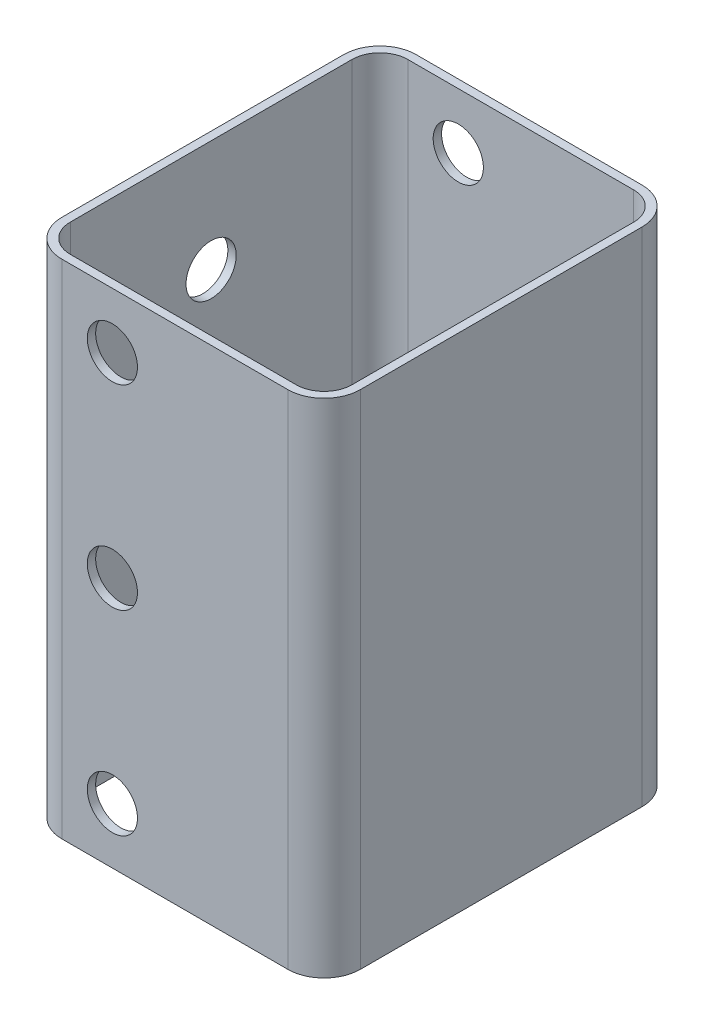
ISO-10303-21;
HEADER;
FILE_DESCRIPTION(('STEP AP214'),'2;1');
FILE_NAME('part.step','',(''),(''),'','','');
FILE_SCHEMA(('AUTOMOTIVE_DESIGN { 1 0 10303 214 1 1 1 1 }'));
ENDSEC;
DATA;
#1=APPLICATION_CONTEXT('core data for automotive mechanical design processes');
#2=APPLICATION_PROTOCOL_DEFINITION('international standard','automotive_design',2000,#1);
#3=PRODUCT_CONTEXT('',#1,'mechanical');
#4=PRODUCT('Part','Part','',(#3));
#5=PRODUCT_RELATED_PRODUCT_CATEGORY('part','',(#4));
#6=PRODUCT_DEFINITION_FORMATION('','',#4);
#7=PRODUCT_DEFINITION_CONTEXT('part definition',#1,'design');
#8=PRODUCT_DEFINITION('design','',#6,#7);
#9=PRODUCT_DEFINITION_SHAPE('','',#8);
#10=(LENGTH_UNIT() NAMED_UNIT(*) SI_UNIT(.MILLI.,.METRE.));
#11=(NAMED_UNIT(*) PLANE_ANGLE_UNIT() SI_UNIT($,.RADIAN.));
#12=(NAMED_UNIT(*) SI_UNIT($,.STERADIAN.) SOLID_ANGLE_UNIT());
#13=UNCERTAINTY_MEASURE_WITH_UNIT(LENGTH_MEASURE(1.E-05),#10,'distance_accuracy_value','');
#14=(GEOMETRIC_REPRESENTATION_CONTEXT(3) GLOBAL_UNCERTAINTY_ASSIGNED_CONTEXT((#13)) GLOBAL_UNIT_ASSIGNED_CONTEXT((#10,
#11,#12)) REPRESENTATION_CONTEXT('',''));
#15=CARTESIAN_POINT('',(0.,0.,0.));
#16=DIRECTION('',(0.,0.,1.));
#17=DIRECTION('',(1.,0.,0.));
#18=AXIS2_PLACEMENT_3D('',#15,#16,#17);
#19=CARTESIAN_POINT('',(-20.25,90.,25.25));
#20=DIRECTION('',(0.,-1.,0.));
#21=DIRECTION('',(0.,0.,-1.));
#22=AXIS2_PLACEMENT_3D('',#19,#20,#21);
#23=PLANE('',#22);
#24=CARTESIAN_POINT('',(-20.25,90.,25.25));
#25=DIRECTION('',(0.,1.,0.));
#26=DIRECTION('',(0.,0.,-1.));
#27=AXIS2_PLACEMENT_3D('',#24,#25,#26);
#28=CIRCLE('',#27,6.5);
#29=CARTESIAN_POINT('',(-26.75,90.,25.25));
#30=VERTEX_POINT('',#29);
#31=CARTESIAN_POINT('',(-20.25,90.,31.75));
#32=VERTEX_POINT('',#31);
#33=EDGE_CURVE('E217',#30,#32,#28,.T.);
#34=ORIENTED_EDGE('',*,*,#33,.T.);
#35=DIRECTION('',(1.,0.,0.));
#36=VECTOR('',#35,1.);
#37=CARTESIAN_POINT('',(-20.25,90.,31.75));
#38=LINE('',#37,#36);
#39=CARTESIAN_POINT('',(20.25,90.,31.75));
#40=VERTEX_POINT('',#39);
#41=EDGE_CURVE('E220',#32,#40,#38,.T.);
#42=ORIENTED_EDGE('',*,*,#41,.T.);
#43=CARTESIAN_POINT('',(20.25,90.,25.25));
#44=DIRECTION('',(0.,1.,0.));
#45=DIRECTION('',(0.,0.,1.));
#46=AXIS2_PLACEMENT_3D('',#43,#44,#45);
#47=CIRCLE('',#46,6.5);
#48=CARTESIAN_POINT('',(26.75,90.,25.25));
#49=VERTEX_POINT('',#48);
#50=EDGE_CURVE('E223',#40,#49,#47,.T.);
#51=ORIENTED_EDGE('',*,*,#50,.T.);
#52=DIRECTION('',(0.,0.,-1.));
#53=VECTOR('',#52,1.);
#54=CARTESIAN_POINT('',(26.75,90.,25.25));
#55=LINE('',#54,#53);
#56=CARTESIAN_POINT('',(26.75,90.,-25.25));
#57=VERTEX_POINT('',#56);
#58=EDGE_CURVE('E225',#49,#57,#55,.T.);
#59=ORIENTED_EDGE('',*,*,#58,.T.);
#60=CARTESIAN_POINT('',(20.25,90.,-25.25));
#61=DIRECTION('',(0.,1.,0.));
#62=DIRECTION('',(0.,0.,-1.));
#63=AXIS2_PLACEMENT_3D('',#60,#61,#62);
#64=CIRCLE('',#63,6.5);
#65=CARTESIAN_POINT('',(20.25,90.,-31.75));
#66=VERTEX_POINT('',#65);
#67=EDGE_CURVE('E227',#57,#66,#64,.T.);
#68=ORIENTED_EDGE('',*,*,#67,.T.);
#69=DIRECTION('',(-1.,0.,0.));
#70=VECTOR('',#69,1.);
#71=CARTESIAN_POINT('',(-20.25,90.,-31.75));
#72=LINE('',#71,#70);
#73=CARTESIAN_POINT('',(-20.25,90.,-31.75));
#74=VERTEX_POINT('',#73);
#75=EDGE_CURVE('E229',#66,#74,#72,.T.);
#76=ORIENTED_EDGE('',*,*,#75,.T.);
#77=CARTESIAN_POINT('',(-20.25,90.,-25.25));
#78=DIRECTION('',(0.,1.,0.));
#79=DIRECTION('',(0.,0.,-1.));
#80=AXIS2_PLACEMENT_3D('',#77,#78,#79);
#81=CIRCLE('',#80,6.5);
#82=CARTESIAN_POINT('',(-26.75,90.,-25.25));
#83=VERTEX_POINT('',#82);
#84=EDGE_CURVE('E231',#74,#83,#81,.T.);
#85=ORIENTED_EDGE('',*,*,#84,.T.);
#86=DIRECTION('',(0.,0.,1.));
#87=VECTOR('',#86,1.);
#88=CARTESIAN_POINT('',(-26.75,90.,25.25));
#89=LINE('',#88,#87);
#90=EDGE_CURVE('E233',#83,#30,#89,.T.);
#91=ORIENTED_EDGE('',*,*,#90,.T.);
#92=EDGE_LOOP('',(#34,#42,#51,#59,#68,#76,#85,#91));
#93=FACE_BOUND('',#92,.T.);
#94=CARTESIAN_POINT('',(20.25,90.,-25.25));
#95=DIRECTION('',(0.,1.,0.));
#96=DIRECTION('',(0.,0.,-1.));
#97=AXIS2_PLACEMENT_3D('',#94,#95,#96);
#98=CIRCLE('',#97,5.);
#99=CARTESIAN_POINT('',(25.25,90.,-25.25));
#100=VERTEX_POINT('',#99);
#101=CARTESIAN_POINT('',(20.25,90.,-30.25));
#102=VERTEX_POINT('',#101);
#103=EDGE_CURVE('E150',#100,#102,#98,.T.);
#104=ORIENTED_EDGE('',*,*,#103,.F.);
#105=DIRECTION('',(0.,0.,-1.));
#106=VECTOR('',#105,1.);
#107=CARTESIAN_POINT('',(25.25,90.,25.25));
#108=LINE('',#107,#106);
#109=CARTESIAN_POINT('',(25.25,90.,25.25));
#110=VERTEX_POINT('',#109);
#111=EDGE_CURVE('E184',#110,#100,#108,.T.);
#112=ORIENTED_EDGE('',*,*,#111,.F.);
#113=CARTESIAN_POINT('',(20.25,90.,25.25));
#114=DIRECTION('',(0.,1.,0.));
#115=DIRECTION('',(0.,0.,1.));
#116=AXIS2_PLACEMENT_3D('',#113,#114,#115);
#117=CIRCLE('',#116,5.);
#118=CARTESIAN_POINT('',(20.25,90.,30.25));
#119=VERTEX_POINT('',#118);
#120=EDGE_CURVE('E182',#119,#110,#117,.T.);
#121=ORIENTED_EDGE('',*,*,#120,.F.);
#122=DIRECTION('',(1.,0.,0.));
#123=VECTOR('',#122,1.);
#124=CARTESIAN_POINT('',(-20.25,90.,30.25));
#125=LINE('',#124,#123);
#126=CARTESIAN_POINT('',(-20.25,90.,30.25));
#127=VERTEX_POINT('',#126);
#128=EDGE_CURVE('E180',#127,#119,#125,.T.);
#129=ORIENTED_EDGE('',*,*,#128,.F.);
#130=CARTESIAN_POINT('',(-20.25,90.,25.25));
#131=DIRECTION('',(0.,1.,0.));
#132=DIRECTION('',(0.,0.,-1.));
#133=AXIS2_PLACEMENT_3D('',#130,#131,#132);
#134=CIRCLE('',#133,5.);
#135=CARTESIAN_POINT('',(-25.25,90.,25.25));
#136=VERTEX_POINT('',#135);
#137=EDGE_CURVE('E178',#136,#127,#134,.T.);
#138=ORIENTED_EDGE('',*,*,#137,.F.);
#139=DIRECTION('',(0.,0.,1.));
#140=VECTOR('',#139,1.);
#141=CARTESIAN_POINT('',(-25.25,90.,25.25));
#142=LINE('',#141,#140);
#143=CARTESIAN_POINT('',(-25.25,90.,-25.25));
#144=VERTEX_POINT('',#143);
#145=EDGE_CURVE('E173',#144,#136,#142,.T.);
#146=ORIENTED_EDGE('',*,*,#145,.F.);
#147=CARTESIAN_POINT('',(-20.25,90.,-25.25));
#148=DIRECTION('',(0.,1.,0.));
#149=DIRECTION('',(0.,0.,-1.));
#150=AXIS2_PLACEMENT_3D('',#147,#148,#149);
#151=CIRCLE('',#150,5.);
#152=CARTESIAN_POINT('',(-20.25,90.,-30.25));
#153=VERTEX_POINT('',#152);
#154=EDGE_CURVE('E171',#153,#144,#151,.T.);
#155=ORIENTED_EDGE('',*,*,#154,.F.);
#156=DIRECTION('',(-1.,0.,0.));
#157=VECTOR('',#156,1.);
#158=CARTESIAN_POINT('',(-20.25,90.,-30.25));
#159=LINE('',#158,#157);
#160=EDGE_CURVE('E158',#102,#153,#159,.T.);
#161=ORIENTED_EDGE('',*,*,#160,.F.);
#162=EDGE_LOOP('',(#104,#112,#121,#129,#138,#146,#155,#161));
#163=FACE_BOUND('',#162,.T.);
#164=ADVANCED_FACE('F35',(#93,#163),#23,.F.);
#165=CARTESIAN_POINT('',(-20.25,0.,25.25));
#166=DIRECTION('',(0.,-1.,0.));
#167=DIRECTION('',(0.,0.,-1.));
#168=AXIS2_PLACEMENT_3D('',#165,#166,#167);
#169=PLANE('',#168);
#170=CARTESIAN_POINT('',(-20.25,0.,25.25));
#171=DIRECTION('',(0.,1.,0.));
#172=DIRECTION('',(0.,0.,-1.));
#173=AXIS2_PLACEMENT_3D('',#170,#171,#172);
#174=CIRCLE('',#173,6.5);
#175=CARTESIAN_POINT('',(-26.75,0.,25.25));
#176=VERTEX_POINT('',#175);
#177=CARTESIAN_POINT('',(-20.25,0.,31.75));
#178=VERTEX_POINT('',#177);
#179=EDGE_CURVE('E166',#176,#178,#174,.T.);
#180=ORIENTED_EDGE('',*,*,#179,.F.);
#181=DIRECTION('',(0.,0.,1.));
#182=VECTOR('',#181,1.);
#183=CARTESIAN_POINT('',(-26.75,0.,25.25));
#184=LINE('',#183,#182);
#185=CARTESIAN_POINT('',(-26.75,0.,-25.25));
#186=VERTEX_POINT('',#185);
#187=EDGE_CURVE('E221',#186,#176,#184,.T.);
#188=ORIENTED_EDGE('',*,*,#187,.F.);
#189=CARTESIAN_POINT('',(-20.25,0.,-25.25));
#190=DIRECTION('',(0.,1.,0.));
#191=DIRECTION('',(0.,0.,-1.));
#192=AXIS2_PLACEMENT_3D('',#189,#190,#191);
#193=CIRCLE('',#192,6.5);
#194=CARTESIAN_POINT('',(-20.25,0.,-31.75));
#195=VERTEX_POINT('',#194);
#196=EDGE_CURVE('E248',#195,#186,#193,.T.);
#197=ORIENTED_EDGE('',*,*,#196,.F.);
#198=DIRECTION('',(-1.,0.,0.));
#199=VECTOR('',#198,1.);
#200=CARTESIAN_POINT('',(-20.25,0.,-31.75));
#201=LINE('',#200,#199);
#202=CARTESIAN_POINT('',(20.25,0.,-31.75));
#203=VERTEX_POINT('',#202);
#204=EDGE_CURVE('E246',#203,#195,#201,.T.);
#205=ORIENTED_EDGE('',*,*,#204,.F.);
#206=CARTESIAN_POINT('',(20.25,0.,-25.25));
#207=DIRECTION('',(0.,1.,0.));
#208=DIRECTION('',(0.,0.,-1.));
#209=AXIS2_PLACEMENT_3D('',#206,#207,#208);
#210=CIRCLE('',#209,6.5);
#211=CARTESIAN_POINT('',(26.75,0.,-25.25));
#212=VERTEX_POINT('',#211);
#213=EDGE_CURVE('E244',#212,#203,#210,.T.);
#214=ORIENTED_EDGE('',*,*,#213,.F.);
#215=DIRECTION('',(0.,0.,-1.));
#216=VECTOR('',#215,1.);
#217=CARTESIAN_POINT('',(26.75,0.,25.25));
#218=LINE('',#217,#216);
#219=CARTESIAN_POINT('',(26.75,0.,25.25));
#220=VERTEX_POINT('',#219);
#221=EDGE_CURVE('E242',#220,#212,#218,.T.);
#222=ORIENTED_EDGE('',*,*,#221,.F.);
#223=CARTESIAN_POINT('',(20.25,0.,25.25));
#224=DIRECTION('',(0.,1.,0.));
#225=DIRECTION('',(0.,0.,1.));
#226=AXIS2_PLACEMENT_3D('',#223,#224,#225);
#227=CIRCLE('',#226,6.5);
#228=CARTESIAN_POINT('',(20.25,0.,31.75));
#229=VERTEX_POINT('',#228);
#230=EDGE_CURVE('E240',#229,#220,#227,.T.);
#231=ORIENTED_EDGE('',*,*,#230,.F.);
#232=DIRECTION('',(1.,0.,0.));
#233=VECTOR('',#232,1.);
#234=CARTESIAN_POINT('',(-20.25,0.,31.75));
#235=LINE('',#234,#233);
#236=EDGE_CURVE('E238',#178,#229,#235,.T.);
#237=ORIENTED_EDGE('',*,*,#236,.F.);
#238=EDGE_LOOP('',(#180,#188,#197,#205,#214,#222,#231,#237));
#239=FACE_BOUND('',#238,.T.);
#240=DIRECTION('',(0.,0.,-1.));
#241=VECTOR('',#240,1.);
#242=CARTESIAN_POINT('',(25.25,0.,25.25));
#243=LINE('',#242,#241);
#244=CARTESIAN_POINT('',(25.25,0.,25.25));
#245=VERTEX_POINT('',#244);
#246=CARTESIAN_POINT('',(25.25,0.,-25.25));
#247=VERTEX_POINT('',#246);
#248=EDGE_CURVE('E159',#245,#247,#243,.T.);
#249=ORIENTED_EDGE('',*,*,#248,.T.);
#250=CARTESIAN_POINT('',(20.25,0.,-25.25));
#251=DIRECTION('',(0.,1.,0.));
#252=DIRECTION('',(0.,0.,-1.));
#253=AXIS2_PLACEMENT_3D('',#250,#251,#252);
#254=CIRCLE('',#253,5.);
#255=CARTESIAN_POINT('',(20.25,0.,-30.25));
#256=VERTEX_POINT('',#255);
#257=EDGE_CURVE('E60',#247,#256,#254,.T.);
#258=ORIENTED_EDGE('',*,*,#257,.T.);
#259=DIRECTION('',(-1.,0.,0.));
#260=VECTOR('',#259,1.);
#261=CARTESIAN_POINT('',(-20.25,0.,-30.25));
#262=LINE('',#261,#260);
#263=CARTESIAN_POINT('',(-20.25,0.,-30.25));
#264=VERTEX_POINT('',#263);
#265=EDGE_CURVE('E165',#256,#264,#262,.T.);
#266=ORIENTED_EDGE('',*,*,#265,.T.);
#267=CARTESIAN_POINT('',(-20.25,0.,-25.25));
#268=DIRECTION('',(0.,1.,0.));
#269=DIRECTION('',(0.,0.,-1.));
#270=AXIS2_PLACEMENT_3D('',#267,#268,#269);
#271=CIRCLE('',#270,5.);
#272=CARTESIAN_POINT('',(-25.25,0.,-25.25));
#273=VERTEX_POINT('',#272);
#274=EDGE_CURVE('E189',#264,#273,#271,.T.);
#275=ORIENTED_EDGE('',*,*,#274,.T.);
#276=DIRECTION('',(0.,0.,1.));
#277=VECTOR('',#276,1.);
#278=CARTESIAN_POINT('',(-25.25,0.,25.25));
#279=LINE('',#278,#277);
#280=CARTESIAN_POINT('',(-25.25,0.,25.25));
#281=VERTEX_POINT('',#280);
#282=EDGE_CURVE('E192',#273,#281,#279,.T.);
#283=ORIENTED_EDGE('',*,*,#282,.T.);
#284=CARTESIAN_POINT('',(-20.25,0.,25.25));
#285=DIRECTION('',(0.,1.,0.));
#286=DIRECTION('',(0.,0.,-1.));
#287=AXIS2_PLACEMENT_3D('',#284,#285,#286);
#288=CIRCLE('',#287,5.);
#289=CARTESIAN_POINT('',(-20.25,0.,30.25));
#290=VERTEX_POINT('',#289);
#291=EDGE_CURVE('E195',#281,#290,#288,.T.);
#292=ORIENTED_EDGE('',*,*,#291,.T.);
#293=DIRECTION('',(1.,0.,0.));
#294=VECTOR('',#293,1.);
#295=CARTESIAN_POINT('',(-20.25,0.,30.25));
#296=LINE('',#295,#294);
#297=CARTESIAN_POINT('',(20.25,0.,30.25));
#298=VERTEX_POINT('',#297);
#299=EDGE_CURVE('E198',#290,#298,#296,.T.);
#300=ORIENTED_EDGE('',*,*,#299,.T.);
#301=CARTESIAN_POINT('',(20.25,0.,25.25));
#302=DIRECTION('',(0.,1.,0.));
#303=DIRECTION('',(0.,0.,1.));
#304=AXIS2_PLACEMENT_3D('',#301,#302,#303);
#305=CIRCLE('',#304,5.);
#306=EDGE_CURVE('E201',#298,#245,#305,.T.);
#307=ORIENTED_EDGE('',*,*,#306,.T.);
#308=EDGE_LOOP('',(#249,#258,#266,#275,#283,#292,#300,#307));
#309=FACE_BOUND('',#308,.T.);
#310=ADVANCED_FACE('F336',(#239,#309),#169,.T.);
#311=CARTESIAN_POINT('',(-20.25,90.,25.25));
#312=DIRECTION('',(0.,-1.,0.));
#313=DIRECTION('',(0.,0.,-1.));
#314=AXIS2_PLACEMENT_3D('',#311,#312,#313);
#315=CYLINDRICAL_SURFACE('',#314,6.5);
#316=ORIENTED_EDGE('',*,*,#179,.T.);
#317=DIRECTION('',(0.,-1.,0.));
#318=VECTOR('',#317,1.);
#319=CARTESIAN_POINT('',(-20.25,90.,31.75));
#320=LINE('',#319,#318);
#321=EDGE_CURVE('E11',#32,#178,#320,.T.);
#322=ORIENTED_EDGE('',*,*,#321,.F.);
#323=ORIENTED_EDGE('',*,*,#33,.F.);
#324=DIRECTION('',(0.,-1.,0.));
#325=VECTOR('',#324,1.);
#326=CARTESIAN_POINT('',(-26.75,90.,25.25));
#327=LINE('',#326,#325);
#328=EDGE_CURVE('E235',#30,#176,#327,.T.);
#329=ORIENTED_EDGE('',*,*,#328,.T.);
#330=EDGE_LOOP('',(#316,#322,#323,#329));
#331=FACE_BOUND('',#330,.T.);
#332=ADVANCED_FACE('F37',(#331),#315,.T.);
#333=CARTESIAN_POINT('',(-20.25,90.,31.75));
#334=DIRECTION('',(0.,0.,-1.));
#335=DIRECTION('',(-1.,0.,0.));
#336=AXIS2_PLACEMENT_3D('',#333,#334,#335);
#337=PLANE('',#336);
#338=CARTESIAN_POINT('',(-11.2,10.,31.75));
#339=DIRECTION('',(0.,0.,-1.));
#340=DIRECTION('',(-1.,0.,0.));
#341=AXIS2_PLACEMENT_3D('',#338,#339,#340);
#342=CIRCLE('',#341,4.5);
#343=CARTESIAN_POINT('',(-15.7,10.,31.75));
#344=VERTEX_POINT('',#343);
#345=EDGE_CURVE('E281',#344,#344,#342,.T.);
#346=ORIENTED_EDGE('',*,*,#345,.T.);
#347=EDGE_LOOP('',(#346));
#348=FACE_BOUND('',#347,.T.);
#349=CARTESIAN_POINT('',(-11.2,45.,31.75));
#350=DIRECTION('',(0.,0.,-1.));
#351=DIRECTION('',(-1.,0.,0.));
#352=AXIS2_PLACEMENT_3D('',#349,#350,#351);
#353=CIRCLE('',#352,4.50000000000001);
#354=CARTESIAN_POINT('',(-15.7,45.,31.75));
#355=VERTEX_POINT('',#354);
#356=EDGE_CURVE('E293',#355,#355,#353,.T.);
#357=ORIENTED_EDGE('',*,*,#356,.T.);
#358=EDGE_LOOP('',(#357));
#359=FACE_BOUND('',#358,.T.);
#360=CARTESIAN_POINT('',(-11.2,80.,31.75));
#361=DIRECTION('',(0.,0.,-1.));
#362=DIRECTION('',(-1.,0.,0.));
#363=AXIS2_PLACEMENT_3D('',#360,#361,#362);
#364=CIRCLE('',#363,4.50000000000001);
#365=CARTESIAN_POINT('',(-15.7,80.,31.75));
#366=VERTEX_POINT('',#365);
#367=EDGE_CURVE('E277',#366,#366,#364,.T.);
#368=ORIENTED_EDGE('',*,*,#367,.T.);
#369=EDGE_LOOP('',(#368));
#370=FACE_BOUND('',#369,.T.);
#371=ORIENTED_EDGE('',*,*,#236,.T.);
#372=DIRECTION('',(0.,-1.,0.));
#373=VECTOR('',#372,1.);
#374=CARTESIAN_POINT('',(20.25,90.,31.75));
#375=LINE('',#374,#373);
#376=EDGE_CURVE('E44',#40,#229,#375,.T.);
#377=ORIENTED_EDGE('',*,*,#376,.F.);
#378=ORIENTED_EDGE('',*,*,#41,.F.);
#379=ORIENTED_EDGE('',*,*,#321,.T.);
#380=EDGE_LOOP('',(#371,#377,#378,#379));
#381=FACE_BOUND('',#380,.T.);
#382=ADVANCED_FACE('F368',(#348,#359,#370,#381),#337,.F.);
#383=CARTESIAN_POINT('',(20.25,90.,25.25));
#384=DIRECTION('',(0.,-1.,0.));
#385=DIRECTION('',(0.,0.,-1.));
#386=AXIS2_PLACEMENT_3D('',#383,#384,#385);
#387=CYLINDRICAL_SURFACE('',#386,6.5);
#388=ORIENTED_EDGE('',*,*,#230,.T.);
#389=DIRECTION('',(0.,-1.,0.));
#390=VECTOR('',#389,1.);
#391=CARTESIAN_POINT('',(26.75,90.,25.25));
#392=LINE('',#391,#390);
#393=EDGE_CURVE('E265',#49,#220,#392,.T.);
#394=ORIENTED_EDGE('',*,*,#393,.F.);
#395=ORIENTED_EDGE('',*,*,#50,.F.);
#396=ORIENTED_EDGE('',*,*,#376,.T.);
#397=EDGE_LOOP('',(#388,#394,#395,#396));
#398=FACE_BOUND('',#397,.T.);
#399=ADVANCED_FACE('F365',(#398),#387,.T.);
#400=CARTESIAN_POINT('',(26.75,90.,25.25));
#401=DIRECTION('',(-1.,0.,0.));
#402=DIRECTION('',(0.,0.,1.));
#403=AXIS2_PLACEMENT_3D('',#400,#401,#402);
#404=PLANE('',#403);
#405=ORIENTED_EDGE('',*,*,#221,.T.);
#406=DIRECTION('',(0.,-1.,0.));
#407=VECTOR('',#406,1.);
#408=CARTESIAN_POINT('',(26.75,90.,-25.25));
#409=LINE('',#408,#407);
#410=EDGE_CURVE('E262',#57,#212,#409,.T.);
#411=ORIENTED_EDGE('',*,*,#410,.F.);
#412=ORIENTED_EDGE('',*,*,#58,.F.);
#413=ORIENTED_EDGE('',*,*,#393,.T.);
#414=EDGE_LOOP('',(#405,#411,#412,#413));
#415=FACE_BOUND('',#414,.T.);
#416=ADVANCED_FACE('F361',(#415),#404,.F.);
#417=CARTESIAN_POINT('',(20.25,90.,-25.25));
#418=DIRECTION('',(0.,-1.,0.));
#419=DIRECTION('',(0.,0.,-1.));
#420=AXIS2_PLACEMENT_3D('',#417,#418,#419);
#421=CYLINDRICAL_SURFACE('',#420,6.5);
#422=ORIENTED_EDGE('',*,*,#213,.T.);
#423=DIRECTION('',(0.,-1.,0.));
#424=VECTOR('',#423,1.);
#425=CARTESIAN_POINT('',(20.25,90.,-31.75));
#426=LINE('',#425,#424);
#427=EDGE_CURVE('E259',#66,#203,#426,.T.);
#428=ORIENTED_EDGE('',*,*,#427,.F.);
#429=ORIENTED_EDGE('',*,*,#67,.F.);
#430=ORIENTED_EDGE('',*,*,#410,.T.);
#431=EDGE_LOOP('',(#422,#428,#429,#430));
#432=FACE_BOUND('',#431,.T.);
#433=ADVANCED_FACE('F357',(#432),#421,.T.);
#434=CARTESIAN_POINT('',(-20.25,90.,-31.75));
#435=DIRECTION('',(0.,0.,1.));
#436=DIRECTION('',(1.,0.,0.));
#437=AXIS2_PLACEMENT_3D('',#434,#435,#436);
#438=PLANE('',#437);
#439=CARTESIAN_POINT('',(-11.2,10.,-31.75));
#440=DIRECTION('',(0.,0.,1.));
#441=DIRECTION('',(1.,0.,0.));
#442=AXIS2_PLACEMENT_3D('',#439,#440,#441);
#443=CIRCLE('',#442,4.5);
#444=CARTESIAN_POINT('',(-6.69999999999999,10.,-31.75));
#445=VERTEX_POINT('',#444);
#446=EDGE_CURVE('E301',#445,#445,#443,.T.);
#447=ORIENTED_EDGE('',*,*,#446,.T.);
#448=EDGE_LOOP('',(#447));
#449=FACE_BOUND('',#448,.T.);
#450=CARTESIAN_POINT('',(-11.2,45.,-31.75));
#451=DIRECTION('',(0.,0.,1.));
#452=DIRECTION('',(1.,0.,0.));
#453=AXIS2_PLACEMENT_3D('',#450,#451,#452);
#454=CIRCLE('',#453,4.50000000000001);
#455=CARTESIAN_POINT('',(-6.69999999999999,45.,-31.75));
#456=VERTEX_POINT('',#455);
#457=EDGE_CURVE('E288',#456,#456,#454,.T.);
#458=ORIENTED_EDGE('',*,*,#457,.T.);
#459=EDGE_LOOP('',(#458));
#460=FACE_BOUND('',#459,.T.);
#461=CARTESIAN_POINT('',(-11.2,80.,-31.75));
#462=DIRECTION('',(0.,0.,1.));
#463=DIRECTION('',(1.,0.,0.));
#464=AXIS2_PLACEMENT_3D('',#461,#462,#463);
#465=CIRCLE('',#464,4.50000000000001);
#466=CARTESIAN_POINT('',(-6.7,80.,-31.75));
#467=VERTEX_POINT('',#466);
#468=EDGE_CURVE('E308',#467,#467,#465,.T.);
#469=ORIENTED_EDGE('',*,*,#468,.T.);
#470=EDGE_LOOP('',(#469));
#471=FACE_BOUND('',#470,.T.);
#472=ORIENTED_EDGE('',*,*,#204,.T.);
#473=DIRECTION('',(0.,-1.,0.));
#474=VECTOR('',#473,1.);
#475=CARTESIAN_POINT('',(-20.25,90.,-31.75));
#476=LINE('',#475,#474);
#477=EDGE_CURVE('E256',#74,#195,#476,.T.);
#478=ORIENTED_EDGE('',*,*,#477,.F.);
#479=ORIENTED_EDGE('',*,*,#75,.F.);
#480=ORIENTED_EDGE('',*,*,#427,.T.);
#481=EDGE_LOOP('',(#472,#478,#479,#480));
#482=FACE_BOUND('',#481,.T.);
#483=ADVANCED_FACE('F353',(#449,#460,#471,#482),#438,.F.);
#484=CARTESIAN_POINT('',(-20.25,90.,-25.25));
#485=DIRECTION('',(0.,-1.,0.));
#486=DIRECTION('',(0.,0.,-1.));
#487=AXIS2_PLACEMENT_3D('',#484,#485,#486);
#488=CYLINDRICAL_SURFACE('',#487,6.5);
#489=ORIENTED_EDGE('',*,*,#196,.T.);
#490=DIRECTION('',(0.,-1.,0.));
#491=VECTOR('',#490,1.);
#492=CARTESIAN_POINT('',(-26.75,90.,-25.25));
#493=LINE('',#492,#491);
#494=EDGE_CURVE('E253',#83,#186,#493,.T.);
#495=ORIENTED_EDGE('',*,*,#494,.F.);
#496=ORIENTED_EDGE('',*,*,#84,.F.);
#497=ORIENTED_EDGE('',*,*,#477,.T.);
#498=EDGE_LOOP('',(#489,#495,#496,#497));
#499=FACE_BOUND('',#498,.T.);
#500=ADVANCED_FACE('F349',(#499),#488,.T.);
#501=CARTESIAN_POINT('',(-26.75,90.,25.25));
#502=DIRECTION('',(1.,0.,0.));
#503=DIRECTION('',(0.,0.,-1.));
#504=AXIS2_PLACEMENT_3D('',#501,#502,#503);
#505=PLANE('',#504);
#506=CARTESIAN_POINT('',(-26.75,20.,0.));
#507=DIRECTION('',(1.,0.,0.));
#508=DIRECTION('',(0.,0.,-1.));
#509=AXIS2_PLACEMENT_3D('',#506,#507,#508);
#510=CIRCLE('',#509,4.5);
#511=CARTESIAN_POINT('',(-26.75,20.,-4.49999999999999));
#512=VERTEX_POINT('',#511);
#513=EDGE_CURVE('E273',#512,#512,#510,.T.);
#514=ORIENTED_EDGE('',*,*,#513,.T.);
#515=EDGE_LOOP('',(#514));
#516=FACE_BOUND('',#515,.T.);
#517=CARTESIAN_POINT('',(-26.75,70.,0.));
#518=DIRECTION('',(1.,0.,0.));
#519=DIRECTION('',(0.,0.,-1.));
#520=AXIS2_PLACEMENT_3D('',#517,#518,#519);
#521=CIRCLE('',#520,4.5);
#522=CARTESIAN_POINT('',(-26.75,70.,-4.5));
#523=VERTEX_POINT('',#522);
#524=EDGE_CURVE('E187',#523,#523,#521,.T.);
#525=ORIENTED_EDGE('',*,*,#524,.T.);
#526=EDGE_LOOP('',(#525));
#527=FACE_BOUND('',#526,.T.);
#528=ORIENTED_EDGE('',*,*,#187,.T.);
#529=ORIENTED_EDGE('',*,*,#328,.F.);
#530=ORIENTED_EDGE('',*,*,#90,.F.);
#531=ORIENTED_EDGE('',*,*,#494,.T.);
#532=EDGE_LOOP('',(#528,#529,#530,#531));
#533=FACE_BOUND('',#532,.T.);
#534=ADVANCED_FACE('F317',(#516,#527,#533),#505,.F.);
#535=CARTESIAN_POINT('',(20.25,90.,-25.25));
#536=DIRECTION('',(0.,-1.,0.));
#537=DIRECTION('',(0.,0.,-1.));
#538=AXIS2_PLACEMENT_3D('',#535,#536,#537);
#539=CYLINDRICAL_SURFACE('',#538,5.);
#540=ORIENTED_EDGE('',*,*,#257,.F.);
#541=DIRECTION('',(0.,-1.,0.));
#542=VECTOR('',#541,1.);
#543=CARTESIAN_POINT('',(25.25,90.,-25.25));
#544=LINE('',#543,#542);
#545=EDGE_CURVE('E154',#100,#247,#544,.T.);
#546=ORIENTED_EDGE('',*,*,#545,.F.);
#547=ORIENTED_EDGE('',*,*,#103,.T.);
#548=DIRECTION('',(0.,-1.,0.));
#549=VECTOR('',#548,1.);
#550=CARTESIAN_POINT('',(20.25,90.,-30.25));
#551=LINE('',#550,#549);
#552=EDGE_CURVE('E153',#102,#256,#551,.T.);
#553=ORIENTED_EDGE('',*,*,#552,.T.);
#554=EDGE_LOOP('',(#540,#546,#547,#553));
#555=FACE_BOUND('',#554,.T.);
#556=ADVANCED_FACE('F152',(#555),#539,.F.);
#557=CARTESIAN_POINT('',(-20.25,90.,-30.25));
#558=DIRECTION('',(0.,0.,1.));
#559=DIRECTION('',(1.,0.,0.));
#560=AXIS2_PLACEMENT_3D('',#557,#558,#559);
#561=PLANE('',#560);
#562=CARTESIAN_POINT('',(-11.2,10.,-30.25));
#563=DIRECTION('',(0.,0.,1.));
#564=DIRECTION('',(1.,0.,0.));
#565=AXIS2_PLACEMENT_3D('',#562,#563,#564);
#566=CIRCLE('',#565,4.5);
#567=CARTESIAN_POINT('',(-6.69999999999999,10.,-30.25));
#568=VERTEX_POINT('',#567);
#569=EDGE_CURVE('E298',#568,#568,#566,.T.);
#570=ORIENTED_EDGE('',*,*,#569,.F.);
#571=EDGE_LOOP('',(#570));
#572=FACE_BOUND('',#571,.T.);
#573=CARTESIAN_POINT('',(-11.2,45.,-30.25));
#574=DIRECTION('',(0.,0.,1.));
#575=DIRECTION('',(1.,0.,0.));
#576=AXIS2_PLACEMENT_3D('',#573,#574,#575);
#577=CIRCLE('',#576,4.50000000000001);
#578=CARTESIAN_POINT('',(-6.69999999999999,45.,-30.25));
#579=VERTEX_POINT('',#578);
#580=EDGE_CURVE('E284',#579,#579,#577,.T.);
#581=ORIENTED_EDGE('',*,*,#580,.F.);
#582=EDGE_LOOP('',(#581));
#583=FACE_BOUND('',#582,.T.);
#584=CARTESIAN_POINT('',(-11.2,80.,-30.25));
#585=DIRECTION('',(0.,0.,1.));
#586=DIRECTION('',(1.,0.,0.));
#587=AXIS2_PLACEMENT_3D('',#584,#585,#586);
#588=CIRCLE('',#587,4.50000000000001);
#589=CARTESIAN_POINT('',(-6.7,80.,-30.25));
#590=VERTEX_POINT('',#589);
#591=EDGE_CURVE('E280',#590,#590,#588,.T.);
#592=ORIENTED_EDGE('',*,*,#591,.F.);
#593=EDGE_LOOP('',(#592));
#594=FACE_BOUND('',#593,.T.);
#595=ORIENTED_EDGE('',*,*,#265,.F.);
#596=ORIENTED_EDGE('',*,*,#552,.F.);
#597=ORIENTED_EDGE('',*,*,#160,.T.);
#598=DIRECTION('',(0.,-1.,0.));
#599=VECTOR('',#598,1.);
#600=CARTESIAN_POINT('',(-20.25,90.,-30.25));
#601=LINE('',#600,#599);
#602=EDGE_CURVE('E167',#153,#264,#601,.T.);
#603=ORIENTED_EDGE('',*,*,#602,.T.);
#604=EDGE_LOOP('',(#595,#596,#597,#603));
#605=FACE_BOUND('',#604,.T.);
#606=ADVANCED_FACE('F162',(#572,#583,#594,#605),#561,.T.);
#607=CARTESIAN_POINT('',(-20.25,90.,-25.25));
#608=DIRECTION('',(0.,-1.,0.));
#609=DIRECTION('',(0.,0.,-1.));
#610=AXIS2_PLACEMENT_3D('',#607,#608,#609);
#611=CYLINDRICAL_SURFACE('',#610,5.);
#612=ORIENTED_EDGE('',*,*,#274,.F.);
#613=ORIENTED_EDGE('',*,*,#602,.F.);
#614=ORIENTED_EDGE('',*,*,#154,.T.);
#615=DIRECTION('',(0.,-1.,0.));
#616=VECTOR('',#615,1.);
#617=CARTESIAN_POINT('',(-25.25,90.,-25.25));
#618=LINE('',#617,#616);
#619=EDGE_CURVE('E214',#144,#273,#618,.T.);
#620=ORIENTED_EDGE('',*,*,#619,.T.);
#621=EDGE_LOOP('',(#612,#613,#614,#620));
#622=FACE_BOUND('',#621,.T.);
#623=ADVANCED_FACE('F426',(#622),#611,.F.);
#624=CARTESIAN_POINT('',(-25.25,90.,25.25));
#625=DIRECTION('',(1.,0.,0.));
#626=DIRECTION('',(0.,0.,-1.));
#627=AXIS2_PLACEMENT_3D('',#624,#625,#626);
#628=PLANE('',#627);
#629=CARTESIAN_POINT('',(-25.25,20.,0.));
#630=DIRECTION('',(1.,0.,0.));
#631=DIRECTION('',(0.,0.,-1.));
#632=AXIS2_PLACEMENT_3D('',#629,#630,#631);
#633=CIRCLE('',#632,4.5);
#634=CARTESIAN_POINT('',(-25.25,20.,-4.49999999999999));
#635=VERTEX_POINT('',#634);
#636=EDGE_CURVE('E274',#635,#635,#633,.T.);
#637=ORIENTED_EDGE('',*,*,#636,.F.);
#638=EDGE_LOOP('',(#637));
#639=FACE_BOUND('',#638,.T.);
#640=CARTESIAN_POINT('',(-25.25,70.,0.));
#641=DIRECTION('',(1.,0.,0.));
#642=DIRECTION('',(0.,0.,-1.));
#643=AXIS2_PLACEMENT_3D('',#640,#641,#642);
#644=CIRCLE('',#643,4.5);
#645=CARTESIAN_POINT('',(-25.25,70.,-4.5));
#646=VERTEX_POINT('',#645);
#647=EDGE_CURVE('E270',#646,#646,#644,.T.);
#648=ORIENTED_EDGE('',*,*,#647,.F.);
#649=EDGE_LOOP('',(#648));
#650=FACE_BOUND('',#649,.T.);
#651=ORIENTED_EDGE('',*,*,#282,.F.);
#652=ORIENTED_EDGE('',*,*,#619,.F.);
#653=ORIENTED_EDGE('',*,*,#145,.T.);
#654=DIRECTION('',(0.,-1.,0.));
#655=VECTOR('',#654,1.);
#656=CARTESIAN_POINT('',(-25.25,90.,25.25));
#657=LINE('',#656,#655);
#658=EDGE_CURVE('E212',#136,#281,#657,.T.);
#659=ORIENTED_EDGE('',*,*,#658,.T.);
#660=EDGE_LOOP('',(#651,#652,#653,#659));
#661=FACE_BOUND('',#660,.T.);
#662=ADVANCED_FACE('F423',(#639,#650,#661),#628,.T.);
#663=CARTESIAN_POINT('',(-20.25,90.,25.25));
#664=DIRECTION('',(0.,-1.,0.));
#665=DIRECTION('',(0.,0.,-1.));
#666=AXIS2_PLACEMENT_3D('',#663,#664,#665);
#667=CYLINDRICAL_SURFACE('',#666,5.);
#668=ORIENTED_EDGE('',*,*,#291,.F.);
#669=ORIENTED_EDGE('',*,*,#658,.F.);
#670=ORIENTED_EDGE('',*,*,#137,.T.);
#671=DIRECTION('',(0.,-1.,0.));
#672=VECTOR('',#671,1.);
#673=CARTESIAN_POINT('',(-20.25,90.,30.25));
#674=LINE('',#673,#672);
#675=EDGE_CURVE('E210',#127,#290,#674,.T.);
#676=ORIENTED_EDGE('',*,*,#675,.T.);
#677=EDGE_LOOP('',(#668,#669,#670,#676));
#678=FACE_BOUND('',#677,.T.);
#679=ADVANCED_FACE('F418',(#678),#667,.F.);
#680=CARTESIAN_POINT('',(-20.25,90.,30.25));
#681=DIRECTION('',(0.,0.,-1.));
#682=DIRECTION('',(-1.,0.,0.));
#683=AXIS2_PLACEMENT_3D('',#680,#681,#682);
#684=PLANE('',#683);
#685=CARTESIAN_POINT('',(-11.2,10.,30.25));
#686=DIRECTION('',(0.,0.,-1.));
#687=DIRECTION('',(-1.,0.,0.));
#688=AXIS2_PLACEMENT_3D('',#685,#686,#687);
#689=CIRCLE('',#688,4.5);
#690=CARTESIAN_POINT('',(-15.7,10.,30.25));
#691=VERTEX_POINT('',#690);
#692=EDGE_CURVE('E39',#691,#691,#689,.T.);
#693=ORIENTED_EDGE('',*,*,#692,.F.);
#694=EDGE_LOOP('',(#693));
#695=FACE_BOUND('',#694,.T.);
#696=CARTESIAN_POINT('',(-11.2,45.,30.25));
#697=DIRECTION('',(0.,0.,-1.));
#698=DIRECTION('',(-1.,0.,0.));
#699=AXIS2_PLACEMENT_3D('',#696,#697,#698);
#700=CIRCLE('',#699,4.50000000000001);
#701=CARTESIAN_POINT('',(-15.7,45.,30.25));
#702=VERTEX_POINT('',#701);
#703=EDGE_CURVE('E282',#702,#702,#700,.T.);
#704=ORIENTED_EDGE('',*,*,#703,.F.);
#705=EDGE_LOOP('',(#704));
#706=FACE_BOUND('',#705,.T.);
#707=CARTESIAN_POINT('',(-11.2,80.,30.25));
#708=DIRECTION('',(0.,0.,-1.));
#709=DIRECTION('',(-1.,0.,0.));
#710=AXIS2_PLACEMENT_3D('',#707,#708,#709);
#711=CIRCLE('',#710,4.50000000000001);
#712=CARTESIAN_POINT('',(-15.7,80.,30.25));
#713=VERTEX_POINT('',#712);
#714=EDGE_CURVE('E278',#713,#713,#711,.T.);
#715=ORIENTED_EDGE('',*,*,#714,.F.);
#716=EDGE_LOOP('',(#715));
#717=FACE_BOUND('',#716,.T.);
#718=ORIENTED_EDGE('',*,*,#299,.F.);
#719=ORIENTED_EDGE('',*,*,#675,.F.);
#720=ORIENTED_EDGE('',*,*,#128,.T.);
#721=DIRECTION('',(0.,-1.,0.));
#722=VECTOR('',#721,1.);
#723=CARTESIAN_POINT('',(20.25,90.,30.25));
#724=LINE('',#723,#722);
#725=EDGE_CURVE('E208',#119,#298,#724,.T.);
#726=ORIENTED_EDGE('',*,*,#725,.T.);
#727=EDGE_LOOP('',(#718,#719,#720,#726));
#728=FACE_BOUND('',#727,.T.);
#729=ADVANCED_FACE('F414',(#695,#706,#717,#728),#684,.T.);
#730=CARTESIAN_POINT('',(20.25,90.,25.25));
#731=DIRECTION('',(0.,-1.,0.));
#732=DIRECTION('',(0.,0.,-1.));
#733=AXIS2_PLACEMENT_3D('',#730,#731,#732);
#734=CYLINDRICAL_SURFACE('',#733,5.);
#735=ORIENTED_EDGE('',*,*,#306,.F.);
#736=ORIENTED_EDGE('',*,*,#725,.F.);
#737=ORIENTED_EDGE('',*,*,#120,.T.);
#738=DIRECTION('',(0.,-1.,0.));
#739=VECTOR('',#738,1.);
#740=CARTESIAN_POINT('',(25.25,90.,25.25));
#741=LINE('',#740,#739);
#742=EDGE_CURVE('E52',#110,#245,#741,.T.);
#743=ORIENTED_EDGE('',*,*,#742,.T.);
#744=EDGE_LOOP('',(#735,#736,#737,#743));
#745=FACE_BOUND('',#744,.T.);
#746=ADVANCED_FACE('F333',(#745),#734,.F.);
#747=CARTESIAN_POINT('',(25.25,90.,25.25));
#748=DIRECTION('',(-1.,0.,0.));
#749=DIRECTION('',(0.,0.,1.));
#750=AXIS2_PLACEMENT_3D('',#747,#748,#749);
#751=PLANE('',#750);
#752=ORIENTED_EDGE('',*,*,#248,.F.);
#753=ORIENTED_EDGE('',*,*,#742,.F.);
#754=ORIENTED_EDGE('',*,*,#111,.T.);
#755=ORIENTED_EDGE('',*,*,#545,.T.);
#756=EDGE_LOOP('',(#752,#753,#754,#755));
#757=FACE_BOUND('',#756,.T.);
#758=ADVANCED_FACE('F323',(#757),#751,.T.);
#759=CARTESIAN_POINT('',(-24.75,70.,0.));
#760=DIRECTION('',(-1.,0.,0.));
#761=DIRECTION('',(0.,0.,1.));
#762=AXIS2_PLACEMENT_3D('',#759,#760,#761);
#763=CYLINDRICAL_SURFACE('',#762,4.5);
#764=ORIENTED_EDGE('',*,*,#647,.T.);
#765=EDGE_LOOP('',(#764));
#766=FACE_BOUND('',#765,.T.);
#767=ORIENTED_EDGE('',*,*,#524,.F.);
#768=EDGE_LOOP('',(#767));
#769=FACE_BOUND('',#768,.T.);
#770=ADVANCED_FACE('F320',(#766,#769),#763,.F.);
#771=CARTESIAN_POINT('',(-24.75,20.,0.));
#772=DIRECTION('',(-1.,0.,0.));
#773=DIRECTION('',(0.,0.,1.));
#774=AXIS2_PLACEMENT_3D('',#771,#772,#773);
#775=CYLINDRICAL_SURFACE('',#774,4.5);
#776=ORIENTED_EDGE('',*,*,#636,.T.);
#777=EDGE_LOOP('',(#776));
#778=FACE_BOUND('',#777,.T.);
#779=ORIENTED_EDGE('',*,*,#513,.F.);
#780=EDGE_LOOP('',(#779));
#781=FACE_BOUND('',#780,.T.);
#782=ADVANCED_FACE('F322',(#778,#781),#775,.F.);
#783=CARTESIAN_POINT('',(-11.2,80.,-62.75));
#784=DIRECTION('',(0.,0.,1.));
#785=DIRECTION('',(1.,0.,0.));
#786=AXIS2_PLACEMENT_3D('',#783,#784,#785);
#787=CYLINDRICAL_SURFACE('',#786,4.50000000000001);
#788=ORIENTED_EDGE('',*,*,#714,.T.);
#789=EDGE_LOOP('',(#788));
#790=FACE_BOUND('',#789,.T.);
#791=ORIENTED_EDGE('',*,*,#367,.F.);
#792=EDGE_LOOP('',(#791));
#793=FACE_BOUND('',#792,.T.);
#794=ADVANCED_FACE('F330',(#790,#793),#787,.F.);
#795=ORIENTED_EDGE('',*,*,#591,.T.);
#796=EDGE_LOOP('',(#795));
#797=FACE_BOUND('',#796,.T.);
#798=ORIENTED_EDGE('',*,*,#468,.F.);
#799=EDGE_LOOP('',(#798));
#800=FACE_BOUND('',#799,.T.);
#801=ADVANCED_FACE('F511',(#797,#800),#787,.F.);
#802=CARTESIAN_POINT('',(-11.2,45.,-62.75));
#803=DIRECTION('',(0.,0.,1.));
#804=DIRECTION('',(1.,0.,0.));
#805=AXIS2_PLACEMENT_3D('',#802,#803,#804);
#806=CYLINDRICAL_SURFACE('',#805,4.50000000000001);
#807=ORIENTED_EDGE('',*,*,#703,.T.);
#808=EDGE_LOOP('',(#807));
#809=FACE_BOUND('',#808,.T.);
#810=ORIENTED_EDGE('',*,*,#356,.F.);
#811=EDGE_LOOP('',(#810));
#812=FACE_BOUND('',#811,.T.);
#813=ADVANCED_FACE('F521',(#809,#812),#806,.F.);
#814=CARTESIAN_POINT('',(-11.2,10.,-62.75));
#815=DIRECTION('',(0.,0.,1.));
#816=DIRECTION('',(1.,0.,0.));
#817=AXIS2_PLACEMENT_3D('',#814,#815,#816);
#818=CYLINDRICAL_SURFACE('',#817,4.5);
#819=ORIENTED_EDGE('',*,*,#692,.T.);
#820=EDGE_LOOP('',(#819));
#821=FACE_BOUND('',#820,.T.);
#822=ORIENTED_EDGE('',*,*,#345,.F.);
#823=EDGE_LOOP('',(#822));
#824=FACE_BOUND('',#823,.T.);
#825=ADVANCED_FACE('F530',(#821,#824),#818,.F.);
#826=ORIENTED_EDGE('',*,*,#580,.T.);
#827=EDGE_LOOP('',(#826));
#828=FACE_BOUND('',#827,.T.);
#829=ORIENTED_EDGE('',*,*,#457,.F.);
#830=EDGE_LOOP('',(#829));
#831=FACE_BOUND('',#830,.T.);
#832=ADVANCED_FACE('F532',(#828,#831),#806,.F.);
#833=ORIENTED_EDGE('',*,*,#569,.T.);
#834=EDGE_LOOP('',(#833));
#835=FACE_BOUND('',#834,.T.);
#836=ORIENTED_EDGE('',*,*,#446,.F.);
#837=EDGE_LOOP('',(#836));
#838=FACE_BOUND('',#837,.T.);
#839=ADVANCED_FACE('F542',(#835,#838),#818,.F.);
#840=CLOSED_SHELL('',(#164,#310,#332,#382,#399,#416,#433,#483,#500,#534,#556,#606,#623,#662,
#679,#729,#746,#758,#770,#782,#794,#801,#813,#825,#832,#839));
#841=MANIFOLD_SOLID_BREP('B2',#840);
#842=ADVANCED_BREP_SHAPE_REPRESENTATION('',(#18,#841),#14);
#843=SHAPE_DEFINITION_REPRESENTATION(#9,#842);
ENDSEC;
END-ISO-10303-21;
